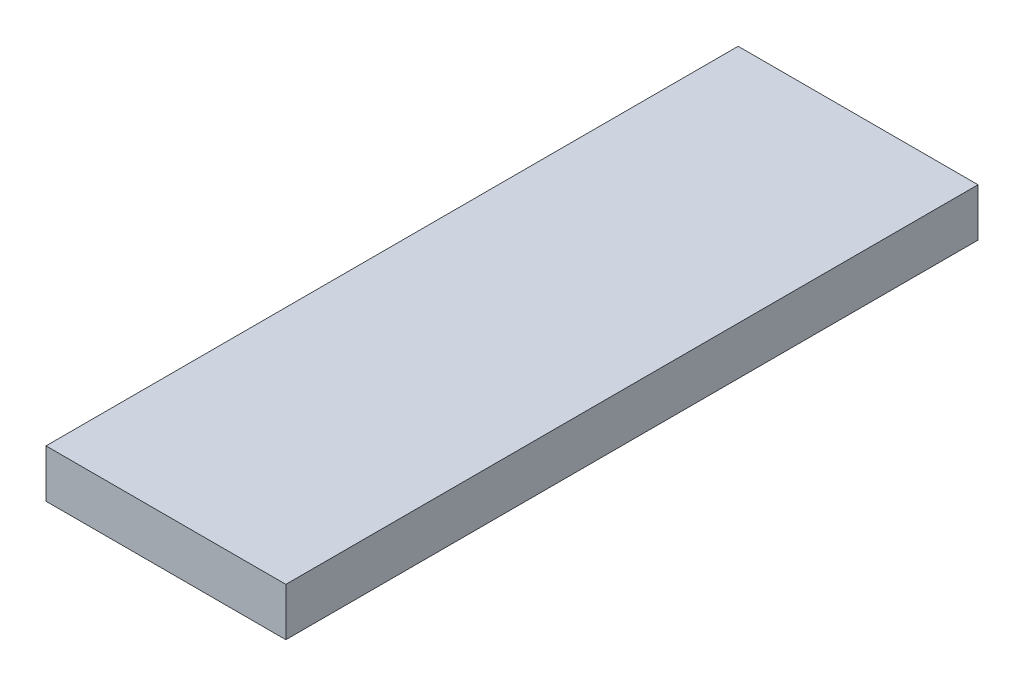
ISO-10303-21;
HEADER;
FILE_DESCRIPTION(('STEP AP214'),'2;1');
FILE_NAME('part.step','',(''),(''),'','','');
FILE_SCHEMA(('AUTOMOTIVE_DESIGN { 1 0 10303 214 1 1 1 1 }'));
ENDSEC;
DATA;
#1=APPLICATION_CONTEXT('core data for automotive mechanical design processes');
#2=APPLICATION_PROTOCOL_DEFINITION('international standard','automotive_design',2000,#1);
#3=PRODUCT_CONTEXT('',#1,'mechanical');
#4=PRODUCT('Part','Part','',(#3));
#5=PRODUCT_RELATED_PRODUCT_CATEGORY('part','',(#4));
#6=PRODUCT_DEFINITION_FORMATION('','',#4);
#7=PRODUCT_DEFINITION_CONTEXT('part definition',#1,'design');
#8=PRODUCT_DEFINITION('design','',#6,#7);
#9=PRODUCT_DEFINITION_SHAPE('','',#8);
#10=(LENGTH_UNIT() NAMED_UNIT(*) SI_UNIT(.MILLI.,.METRE.));
#11=(NAMED_UNIT(*) PLANE_ANGLE_UNIT() SI_UNIT($,.RADIAN.));
#12=(NAMED_UNIT(*) SI_UNIT($,.STERADIAN.) SOLID_ANGLE_UNIT());
#13=UNCERTAINTY_MEASURE_WITH_UNIT(LENGTH_MEASURE(1.E-05),#10,'distance_accuracy_value','');
#14=(GEOMETRIC_REPRESENTATION_CONTEXT(3) GLOBAL_UNCERTAINTY_ASSIGNED_CONTEXT((#13)) GLOBAL_UNIT_ASSIGNED_CONTEXT((#10,
#11,#12)) REPRESENTATION_CONTEXT('',''));
#15=CARTESIAN_POINT('',(0.,0.,0.));
#16=DIRECTION('',(0.,0.,1.));
#17=DIRECTION('',(1.,0.,0.));
#18=AXIS2_PLACEMENT_3D('',#15,#16,#17);
#19=CARTESIAN_POINT('',(-17.5,7.,50.5000000000004));
#20=DIRECTION('',(1.,0.,0.));
#21=DIRECTION('',(0.,0.,-1.));
#22=AXIS2_PLACEMENT_3D('',#19,#20,#21);
#23=PLANE('',#22);
#24=DIRECTION('',(0.,0.,1.));
#25=VECTOR('',#24,1.);
#26=CARTESIAN_POINT('',(-17.5,0.,50.5000000000004));
#27=LINE('',#26,#25);
#28=CARTESIAN_POINT('',(-17.5,0.,-50.4999999999996));
#29=VERTEX_POINT('',#28);
#30=CARTESIAN_POINT('',(-17.5,0.,50.5000000000004));
#31=VERTEX_POINT('',#30);
#32=EDGE_CURVE('E97',#29,#31,#27,.T.);
#33=ORIENTED_EDGE('',*,*,#32,.T.);
#34=DIRECTION('',(0.,-1.,0.));
#35=VECTOR('',#34,1.);
#36=CARTESIAN_POINT('',(-17.5,7.,50.5000000000004));
#37=LINE('',#36,#35);
#38=CARTESIAN_POINT('',(-17.5,7.,50.5000000000004));
#39=VERTEX_POINT('',#38);
#40=EDGE_CURVE('E11',#39,#31,#37,.T.);
#41=ORIENTED_EDGE('',*,*,#40,.F.);
#42=DIRECTION('',(0.,0.,1.));
#43=VECTOR('',#42,1.);
#44=CARTESIAN_POINT('',(-17.5,7.,50.5000000000004));
#45=LINE('',#44,#43);
#46=CARTESIAN_POINT('',(-17.5,7.,-50.4999999999996));
#47=VERTEX_POINT('',#46);
#48=EDGE_CURVE('E85',#47,#39,#45,.T.);
#49=ORIENTED_EDGE('',*,*,#48,.F.);
#50=DIRECTION('',(0.,-1.,0.));
#51=VECTOR('',#50,1.);
#52=CARTESIAN_POINT('',(-17.5,7.,-50.4999999999996));
#53=LINE('',#52,#51);
#54=EDGE_CURVE('E93',#47,#29,#53,.T.);
#55=ORIENTED_EDGE('',*,*,#54,.T.);
#56=EDGE_LOOP('',(#33,#41,#49,#55));
#57=FACE_BOUND('',#56,.T.);
#58=ADVANCED_FACE('F34',(#57),#23,.F.);
#59=CARTESIAN_POINT('',(17.5000000000001,7.,50.5000000000004));
#60=DIRECTION('',(0.,0.,-1.));
#61=DIRECTION('',(-1.,0.,0.));
#62=AXIS2_PLACEMENT_3D('',#59,#60,#61);
#63=PLANE('',#62);
#64=DIRECTION('',(1.,0.,0.));
#65=VECTOR('',#64,1.);
#66=CARTESIAN_POINT('',(17.5000000000001,0.,50.5000000000004));
#67=LINE('',#66,#65);
#68=CARTESIAN_POINT('',(17.5000000000001,0.,50.5000000000004));
#69=VERTEX_POINT('',#68);
#70=EDGE_CURVE('E89',#31,#69,#67,.T.);
#71=ORIENTED_EDGE('',*,*,#70,.T.);
#72=DIRECTION('',(0.,-1.,0.));
#73=VECTOR('',#72,1.);
#74=CARTESIAN_POINT('',(17.5000000000001,7.,50.5000000000004));
#75=LINE('',#74,#73);
#76=CARTESIAN_POINT('',(17.5000000000001,7.,50.5000000000004));
#77=VERTEX_POINT('',#76);
#78=EDGE_CURVE('E42',#77,#69,#75,.T.);
#79=ORIENTED_EDGE('',*,*,#78,.F.);
#80=DIRECTION('',(1.,0.,0.));
#81=VECTOR('',#80,1.);
#82=CARTESIAN_POINT('',(17.5000000000001,7.,50.5000000000004));
#83=LINE('',#82,#81);
#84=EDGE_CURVE('E80',#39,#77,#83,.T.);
#85=ORIENTED_EDGE('',*,*,#84,.F.);
#86=ORIENTED_EDGE('',*,*,#40,.T.);
#87=EDGE_LOOP('',(#71,#79,#85,#86));
#88=FACE_BOUND('',#87,.T.);
#89=ADVANCED_FACE('F88',(#88),#63,.F.);
#90=CARTESIAN_POINT('',(17.5000000000001,7.,50.5000000000004));
#91=DIRECTION('',(-1.,0.,0.));
#92=DIRECTION('',(0.,0.,1.));
#93=AXIS2_PLACEMENT_3D('',#90,#91,#92);
#94=PLANE('',#93);
#95=DIRECTION('',(0.,0.,-1.));
#96=VECTOR('',#95,1.);
#97=CARTESIAN_POINT('',(17.5000000000001,0.,50.5000000000004));
#98=LINE('',#97,#96);
#99=CARTESIAN_POINT('',(17.5000000000001,0.,-50.4999999999997));
#100=VERTEX_POINT('',#99);
#101=EDGE_CURVE('E67',#69,#100,#98,.T.);
#102=ORIENTED_EDGE('',*,*,#101,.T.);
#103=DIRECTION('',(0.,-1.,0.));
#104=VECTOR('',#103,1.);
#105=CARTESIAN_POINT('',(17.5000000000001,7.,-50.4999999999997));
#106=LINE('',#105,#104);
#107=CARTESIAN_POINT('',(17.5000000000001,7.,-50.4999999999997));
#108=VERTEX_POINT('',#107);
#109=EDGE_CURVE('E90',#108,#100,#106,.T.);
#110=ORIENTED_EDGE('',*,*,#109,.F.);
#111=DIRECTION('',(0.,0.,-1.));
#112=VECTOR('',#111,1.);
#113=CARTESIAN_POINT('',(17.5000000000001,7.,50.5000000000004));
#114=LINE('',#113,#112);
#115=EDGE_CURVE('E83',#77,#108,#114,.T.);
#116=ORIENTED_EDGE('',*,*,#115,.F.);
#117=ORIENTED_EDGE('',*,*,#78,.T.);
#118=EDGE_LOOP('',(#102,#110,#116,#117));
#119=FACE_BOUND('',#118,.T.);
#120=ADVANCED_FACE('F91',(#119),#94,.F.);
#121=CARTESIAN_POINT('',(17.5000000000001,7.,-50.4999999999997));
#122=DIRECTION('',(0.,0.,1.));
#123=DIRECTION('',(1.,0.,0.));
#124=AXIS2_PLACEMENT_3D('',#121,#122,#123);
#125=PLANE('',#124);
#126=DIRECTION('',(-1.,0.,0.));
#127=VECTOR('',#126,1.);
#128=CARTESIAN_POINT('',(17.5000000000001,0.,-50.4999999999997));
#129=LINE('',#128,#127);
#130=EDGE_CURVE('E73',#100,#29,#129,.T.);
#131=ORIENTED_EDGE('',*,*,#130,.T.);
#132=ORIENTED_EDGE('',*,*,#54,.F.);
#133=DIRECTION('',(-1.,0.,0.));
#134=VECTOR('',#133,1.);
#135=CARTESIAN_POINT('',(17.5000000000001,7.,-50.4999999999997));
#136=LINE('',#135,#134);
#137=EDGE_CURVE('E50',#108,#47,#136,.T.);
#138=ORIENTED_EDGE('',*,*,#137,.F.);
#139=ORIENTED_EDGE('',*,*,#109,.T.);
#140=EDGE_LOOP('',(#131,#132,#138,#139));
#141=FACE_BOUND('',#140,.T.);
#142=ADVANCED_FACE('F104',(#141),#125,.F.);
#143=CARTESIAN_POINT('',(0.,7.,0.));
#144=DIRECTION('',(0.,1.,0.));
#145=DIRECTION('',(0.,0.,1.));
#146=AXIS2_PLACEMENT_3D('',#143,#144,#145);
#147=PLANE('',#146);
#148=ORIENTED_EDGE('',*,*,#48,.T.);
#149=ORIENTED_EDGE('',*,*,#84,.T.);
#150=ORIENTED_EDGE('',*,*,#115,.T.);
#151=ORIENTED_EDGE('',*,*,#137,.T.);
#152=EDGE_LOOP('',(#148,#149,#150,#151));
#153=FACE_BOUND('',#152,.T.);
#154=ADVANCED_FACE('F81',(#153),#147,.T.);
#155=CARTESIAN_POINT('',(0.,0.,0.));
#156=DIRECTION('',(0.,1.,0.));
#157=DIRECTION('',(0.,0.,1.));
#158=AXIS2_PLACEMENT_3D('',#155,#156,#157);
#159=PLANE('',#158);
#160=ORIENTED_EDGE('',*,*,#32,.F.);
#161=ORIENTED_EDGE('',*,*,#130,.F.);
#162=ORIENTED_EDGE('',*,*,#101,.F.);
#163=ORIENTED_EDGE('',*,*,#70,.F.);
#164=EDGE_LOOP('',(#160,#161,#162,#163));
#165=FACE_BOUND('',#164,.T.);
#166=ADVANCED_FACE('F107',(#165),#159,.F.);
#167=CLOSED_SHELL('',(#58,#89,#120,#142,#154,#166));
#168=MANIFOLD_SOLID_BREP('B2',#167);
#169=ADVANCED_BREP_SHAPE_REPRESENTATION('',(#18,#168),#14);
#170=SHAPE_DEFINITION_REPRESENTATION(#9,#169);
ENDSEC;
END-ISO-10303-21;
